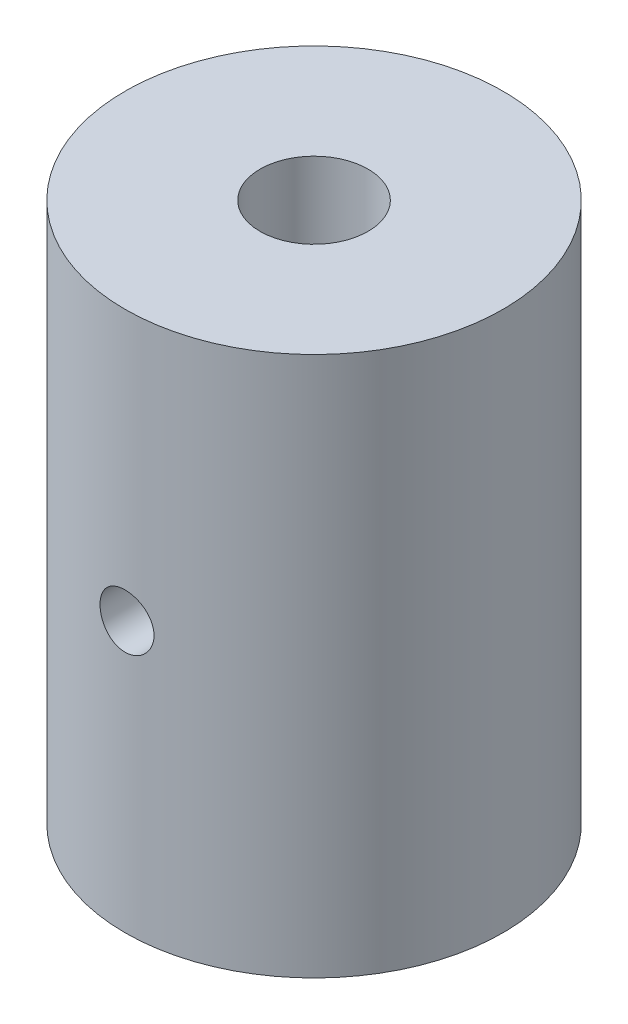
ISO-10303-21;
HEADER;
FILE_DESCRIPTION(('STEP AP214'),'2;1');
FILE_NAME('part.step','',(''),(''),'','','');
FILE_SCHEMA(('AUTOMOTIVE_DESIGN { 1 0 10303 214 1 1 1 1 }'));
ENDSEC;
DATA;
#1=APPLICATION_CONTEXT('core data for automotive mechanical design processes');
#2=APPLICATION_PROTOCOL_DEFINITION('international standard','automotive_design',2000,#1);
#3=PRODUCT_CONTEXT('',#1,'mechanical');
#4=PRODUCT('Part','Part','',(#3));
#5=PRODUCT_RELATED_PRODUCT_CATEGORY('part','',(#4));
#6=PRODUCT_DEFINITION_FORMATION('','',#4);
#7=PRODUCT_DEFINITION_CONTEXT('part definition',#1,'design');
#8=PRODUCT_DEFINITION('design','',#6,#7);
#9=PRODUCT_DEFINITION_SHAPE('','',#8);
#10=(LENGTH_UNIT() NAMED_UNIT(*) SI_UNIT(.MILLI.,.METRE.));
#11=(NAMED_UNIT(*) PLANE_ANGLE_UNIT() SI_UNIT($,.RADIAN.));
#12=(NAMED_UNIT(*) SI_UNIT($,.STERADIAN.) SOLID_ANGLE_UNIT());
#13=UNCERTAINTY_MEASURE_WITH_UNIT(LENGTH_MEASURE(1.E-05),#10,'distance_accuracy_value','');
#14=(GEOMETRIC_REPRESENTATION_CONTEXT(3) GLOBAL_UNCERTAINTY_ASSIGNED_CONTEXT((#13)) GLOBAL_UNIT_ASSIGNED_CONTEXT((#10,
#11,#12)) REPRESENTATION_CONTEXT('',''));
#15=CARTESIAN_POINT('',(0.,0.,0.));
#16=DIRECTION('',(0.,0.,1.));
#17=DIRECTION('',(1.,0.,0.));
#18=AXIS2_PLACEMENT_3D('',#15,#16,#17);
#19=CARTESIAN_POINT('',(0.,10.,0.));
#20=DIRECTION('',(0.,1.,0.));
#21=DIRECTION('',(0.,0.,1.));
#22=AXIS2_PLACEMENT_3D('',#19,#20,#21);
#23=PLANE('',#22);
#24=CARTESIAN_POINT('',(0.,10.,0.));
#25=DIRECTION('',(0.,1.,0.));
#26=DIRECTION('',(0.,0.,1.));
#27=AXIS2_PLACEMENT_3D('',#24,#25,#26);
#28=CIRCLE('',#27,3.5);
#29=CARTESIAN_POINT('',(0.,10.,3.5));
#30=VERTEX_POINT('',#29);
#31=EDGE_CURVE('E10',#30,#30,#28,.T.);
#32=ORIENTED_EDGE('',*,*,#31,.T.);
#33=EDGE_LOOP('',(#32));
#34=FACE_BOUND('',#33,.T.);
#35=CARTESIAN_POINT('',(0.,10.,0.));
#36=DIRECTION('',(0.,1.,0.));
#37=DIRECTION('',(0.,0.,1.));
#38=AXIS2_PLACEMENT_3D('',#35,#36,#37);
#39=CIRCLE('',#38,1.);
#40=CARTESIAN_POINT('',(0.,10.,1.));
#41=VERTEX_POINT('',#40);
#42=EDGE_CURVE('E49',#41,#41,#39,.T.);
#43=ORIENTED_EDGE('',*,*,#42,.F.);
#44=EDGE_LOOP('',(#43));
#45=FACE_BOUND('',#44,.T.);
#46=ADVANCED_FACE('F31',(#34,#45),#23,.T.);
#47=CARTESIAN_POINT('',(0.,0.,0.));
#48=DIRECTION('',(0.,1.,0.));
#49=DIRECTION('',(0.,0.,1.));
#50=AXIS2_PLACEMENT_3D('',#47,#48,#49);
#51=PLANE('',#50);
#52=CARTESIAN_POINT('',(0.,0.,0.));
#53=DIRECTION('',(0.,1.,0.));
#54=DIRECTION('',(0.,0.,1.));
#55=AXIS2_PLACEMENT_3D('',#52,#53,#54);
#56=CIRCLE('',#55,3.5);
#57=CARTESIAN_POINT('',(0.,0.,3.5));
#58=VERTEX_POINT('',#57);
#59=EDGE_CURVE('E44',#58,#58,#56,.T.);
#60=ORIENTED_EDGE('',*,*,#59,.F.);
#61=EDGE_LOOP('',(#60));
#62=FACE_BOUND('',#61,.T.);
#63=CARTESIAN_POINT('',(0.,0.,0.));
#64=DIRECTION('',(0.,1.,0.));
#65=DIRECTION('',(0.,0.,1.));
#66=AXIS2_PLACEMENT_3D('',#63,#64,#65);
#67=CIRCLE('',#66,1.);
#68=CARTESIAN_POINT('',(0.,0.,1.));
#69=VERTEX_POINT('',#68);
#70=EDGE_CURVE('E51',#69,#69,#67,.T.);
#71=ORIENTED_EDGE('',*,*,#70,.T.);
#72=EDGE_LOOP('',(#71));
#73=FACE_BOUND('',#72,.T.);
#74=ADVANCED_FACE('F71',(#62,#73),#51,.F.);
#75=CARTESIAN_POINT('',(0.,10.,0.));
#76=DIRECTION('',(0.,-1.,0.));
#77=DIRECTION('',(0.,0.,-1.));
#78=AXIS2_PLACEMENT_3D('',#75,#76,#77);
#79=CYLINDRICAL_SURFACE('',#78,3.5);
#80=CARTESIAN_POINT('',(0.5,5.,3.46410161513775));
#81=CARTESIAN_POINT('',(0.499998835290119,4.97206895719218,3.4641020643435));
#82=CARTESIAN_POINT('',(0.497651661268469,4.94412132181371,3.46444308020949));
#83=CARTESIAN_POINT('',(0.488326850345959,4.8890063409005,3.46576949811215));
#84=CARTESIAN_POINT('',(0.481344599054395,4.86183980112247,3.46675554228407));
#85=CARTESIAN_POINT('',(0.462961847090697,4.80909282499056,3.46925810653171));
#86=CARTESIAN_POINT('',(0.451564617805072,4.78351123047427,3.4707742337485));
#87=CARTESIAN_POINT('',(0.424682939723154,4.73462756763358,3.47416566651574));
#88=CARTESIAN_POINT('',(0.409199094751845,4.71132516324009,3.47604091899178));
#89=CARTESIAN_POINT('',(0.374463367100457,4.66748792603801,3.47995456313334));
#90=CARTESIAN_POINT('',(0.355187641068314,4.64697207153348,3.48199393618034));
#91=CARTESIAN_POINT('',(0.313466769741796,4.6094546106899,3.48599725779759));
#92=CARTESIAN_POINT('',(0.291021455462784,4.59245319183994,3.48796120233931));
#93=CARTESIAN_POINT('',(0.24347759600512,4.56237772556007,3.49160259255683));
#94=CARTESIAN_POINT('',(0.218367941554022,4.54932107137039,3.49327875573358));
#95=CARTESIAN_POINT('',(0.166284186490775,4.52761731616805,3.49614487863238));
#96=CARTESIAN_POINT('',(0.139310175509832,4.51897000333815,3.49733486170914));
#97=CARTESIAN_POINT('',(0.0844585158852377,4.50638769825893,3.49908762502242));
#98=CARTESIAN_POINT('',(0.0565882812674696,4.50242098250844,3.49965462579527));
#99=CARTESIAN_POINT('',(0.00057239131959989,4.49921402535835,3.50011198870958));
#100=CARTESIAN_POINT('',(-0.0275732499851446,4.49997354450847,3.50000238513058));
#101=CARTESIAN_POINT('',(-0.0831247480464674,4.50617234455395,3.49912227365816));
#102=CARTESIAN_POINT('',(-0.110534499942759,4.51157749972063,3.49835658533107));
#103=CARTESIAN_POINT('',(-0.164053898782174,4.5268606399248,3.49625571353159));
#104=CARTESIAN_POINT('',(-0.190163514815471,4.53673873124695,3.49492051652673));
#105=CARTESIAN_POINT('',(-0.240445491691934,4.56072268619589,3.49182235092745));
#106=CARTESIAN_POINT('',(-0.264610848197767,4.57484303777971,3.49005792042928));
#107=CARTESIAN_POINT('',(-0.310241955034411,4.60690012318507,3.48629816674057));
#108=CARTESIAN_POINT('',(-0.331707543852957,4.6248370851608,3.48430282974987));
#109=CARTESIAN_POINT('',(-0.371530747765965,4.664208650419,3.48028301235951));
#110=CARTESIAN_POINT('',(-0.389858923330459,4.6856730331873,3.47825843077807));
#111=CARTESIAN_POINT('',(-0.422657473975308,4.73138863035737,3.47442573468916));
#112=CARTESIAN_POINT('',(-0.437127829290446,4.7556398590364,3.47261762129076));
#113=CARTESIAN_POINT('',(-0.461803253801987,4.80627007247655,3.46942263420731));
#114=CARTESIAN_POINT('',(-0.472005500629445,4.83265045147065,3.46803603942467));
#115=CARTESIAN_POINT('',(-0.487826559270801,4.88677439495647,3.46584616452237));
#116=CARTESIAN_POINT('',(-0.493445662700756,4.91451787259789,3.46504284729032));
#117=CARTESIAN_POINT('',(-0.499900976720484,4.97031913435751,3.4641174518933));
#118=CARTESIAN_POINT('',(-0.50077882776118,4.9983720064989,3.46398944300777));
#119=CARTESIAN_POINT('',(-0.497837020617802,5.05422445125629,3.46441343133179));
#120=CARTESIAN_POINT('',(-0.494017494208425,5.08202403095582,3.46496540946578));
#121=CARTESIAN_POINT('',(-0.481824594638004,5.13645304500711,3.46668174131291));
#122=CARTESIAN_POINT('',(-0.473471789611052,5.16308718176633,3.46784332836313));
#123=CARTESIAN_POINT('',(-0.452470765428658,5.21457719936412,3.47064572803043));
#124=CARTESIAN_POINT('',(-0.439822352425353,5.23943299989043,3.47228656227403));
#125=CARTESIAN_POINT('',(-0.410488400828064,5.28684796993037,3.47587662103354));
#126=CARTESIAN_POINT('',(-0.393775800067812,5.30939024030309,3.47782788113076));
#127=CARTESIAN_POINT('',(-0.356825694553412,5.35136493090638,3.48181272716481));
#128=CARTESIAN_POINT('',(-0.336588009550541,5.37079719201478,3.48384631730737));
#129=CARTESIAN_POINT('',(-0.292979271571339,5.40614880460845,3.48778513103478));
#130=CARTESIAN_POINT('',(-0.269585793031082,5.42204063057988,3.48968927390463));
#131=CARTESIAN_POINT('',(-0.220437176192799,5.44966889078393,3.49313805389951));
#132=CARTESIAN_POINT('',(-0.194682097544114,5.46140542993449,3.49468270010122));
#133=CARTESIAN_POINT('',(-0.141628981148483,5.48034552857893,3.4972336946111));
#134=CARTESIAN_POINT('',(-0.114336499780982,5.48756439715687,3.49824185914305));
#135=CARTESIAN_POINT('',(-0.0589113147614463,5.49731386677665,3.49961389779132));
#136=CARTESIAN_POINT('',(-0.0307786613285695,5.49984474746346,3.49997781033809));
#137=CARTESIAN_POINT('',(0.0252607826567893,5.50014005973612,3.50002001917979));
#138=CARTESIAN_POINT('',(0.0531673554376459,5.49794670475461,3.49970438755599));
#139=CARTESIAN_POINT('',(0.108210658369968,5.48894596248924,3.49843516068761));
#140=CARTESIAN_POINT('',(0.13534739033886,5.48213858609903,3.49748156694926));
#141=CARTESIAN_POINT('',(0.188070928624313,5.46411750564295,3.49504305513564));
#142=CARTESIAN_POINT('',(0.213658657551746,5.45290645487882,3.49355845704917));
#143=CARTESIAN_POINT('',(0.262596426462871,5.42640071269949,3.49022140025573));
#144=CARTESIAN_POINT('',(0.285946407491638,5.41110591373547,3.48836893186093));
#145=CARTESIAN_POINT('',(0.329960487400663,5.37671307119416,3.48448261865867));
#146=CARTESIAN_POINT('',(0.350600041579964,5.35758377329188,3.48244736464768));
#147=CARTESIAN_POINT('',(0.388391791818108,5.31613060994117,3.47843555856542));
#148=CARTESIAN_POINT('',(0.405543166576824,5.29380599425086,3.47645902041229));
#149=CARTESIAN_POINT('',(0.435948808688983,5.24646364041609,3.47277771962972));
#150=CARTESIAN_POINT('',(0.449182885752493,5.22143282739724,3.47107438506959));
#151=CARTESIAN_POINT('',(0.471239756267733,5.16949192584885,3.46814907033844));
#152=CARTESIAN_POINT('',(0.480067194805338,5.14258385042062,3.46692658359008));
#153=CARTESIAN_POINT('',(0.491023137913952,5.09629089354243,3.46538823054796));
#154=CARTESIAN_POINT('',(0.494384406323876,5.07719391614755,3.46490825998513));
#155=CARTESIAN_POINT('',(0.498873228771313,5.03873395075835,3.46426479827912));
#156=CARTESIAN_POINT('',(0.500000807759143,5.01937096573777,3.4641013036009));
#157=CARTESIAN_POINT('',(0.5,5.,3.46410161513775));
#158=B_SPLINE_CURVE_WITH_KNOTS('',3,(#80,#81,#82,#83,#84,#85,#86,#87,#88,#89,#90,#91,#92,#93,
#94,#95,#96,#97,#98,#99,#100,#101,#102,#103,#104,#105,#106,#107,#108,#109,#110,#111,#112,#113,
#114,#115,#116,#117,#118,#119,#120,#121,#122,#123,#124,#125,#126,#127,#128,#129,#130,#131,#132,
#133,#134,#135,#136,#137,#138,#139,#140,#141,#142,#143,#144,#145,#146,#147,#148,#149,#150,#151,
#152,#153,#154,#155,#156,#157),.UNSPECIFIED.,.T.,.F.,(4,2,2,2,2,2,2,2,2,2,2,2,2,2,2,2,2,2,2,2,2,
2,2,2,2,2,2,2,2,2,2,2,2,2,2,2,2,2,4),(0.,0.0837223373489733,0.16752814862522,0.251271980342048,
0.335003445264419,0.419279289116199,0.503559627779993,0.588206326683658,0.6728489589212,
0.756914555340194,0.840975892688898,0.924424962262254,1.00787601483293,1.09161536909712,
1.17535973064625,1.25985129495926,1.34434329214935,1.42889107332132,1.51343347447084,
1.59723215270005,1.68102848019341,1.7644477520044,1.84787078877646,1.93186530252231,
2.01586411243515,2.10049480379907,2.18512335814779,2.26946355534092,2.35379872136241,
2.43738343825381,2.5209679578034,2.60450219307146,2.68803862849862,2.77228587326531,
2.85655293133939,2.94124703877999,3.02585167971589,3.0839161299067,3.14197993151379),.UNSPECIFIED.);
#159=CARTESIAN_POINT('',(0.5,5.,3.46410161513775));
#160=VERTEX_POINT('',#159);
#161=EDGE_CURVE('E54',#160,#160,#158,.T.);
#162=ORIENTED_EDGE('',*,*,#161,.T.);
#163=EDGE_LOOP('',(#162));
#164=FACE_BOUND('',#163,.T.);
#165=ORIENTED_EDGE('',*,*,#31,.F.);
#166=EDGE_LOOP('',(#165));
#167=FACE_BOUND('',#166,.T.);
#168=ORIENTED_EDGE('',*,*,#59,.T.);
#169=EDGE_LOOP('',(#168));
#170=FACE_BOUND('',#169,.T.);
#171=ADVANCED_FACE('F33',(#164,#167,#170),#79,.T.);
#172=CARTESIAN_POINT('',(0.,10.,0.));
#173=DIRECTION('',(0.,-1.,0.));
#174=DIRECTION('',(0.,0.,-1.));
#175=AXIS2_PLACEMENT_3D('',#172,#173,#174);
#176=CYLINDRICAL_SURFACE('',#175,1.);
#177=CARTESIAN_POINT('',(0.5,5.,0.866025403784439));
#178=CARTESIAN_POINT('',(0.499998181537063,4.97394609590252,0.866027673641386));
#179=CARTESIAN_POINT('',(0.497949985366554,4.94785929423752,0.867219005938538));
#180=CARTESIAN_POINT('',(0.489861604949081,4.89648636766139,0.871811832260506));
#181=CARTESIAN_POINT('',(0.483813032277104,4.87120204247829,0.875217970277862));
#182=CARTESIAN_POINT('',(0.468049974349892,4.82227416782804,0.883746733026927));
#183=CARTESIAN_POINT('',(0.458354976246861,4.79862267376321,0.888860217366243));
#184=CARTESIAN_POINT('',(0.43563376268819,4.75328789900164,0.900213324084306));
#185=CARTESIAN_POINT('',(0.422607367017888,4.73160472486877,0.906453007380328));
#186=CARTESIAN_POINT('',(0.392333270265438,4.68884713572125,0.919984345287202));
#187=CARTESIAN_POINT('',(0.374826018071885,4.66797043216323,0.927320318189766));
#188=CARTESIAN_POINT('',(0.336626903807234,4.62929580579665,0.94185991392853));
#189=CARTESIAN_POINT('',(0.315933462891146,4.61149941870824,0.94906346915625));
#190=CARTESIAN_POINT('',(0.270244781707273,4.57831642442617,0.963107384764745));
#191=CARTESIAN_POINT('',(0.245053594506288,4.56317311607024,0.969890532090862));
#192=CARTESIAN_POINT('',(0.192078513299752,4.53742957337712,0.981753780497645));
#193=CARTESIAN_POINT('',(0.164296269069078,4.52682647193142,0.986834955918708));
#194=CARTESIAN_POINT('',(0.109022471962989,4.51124766934945,0.994402306221187));
#195=CARTESIAN_POINT('',(0.0816508952444092,4.50592523682223,0.99704740110446));
#196=CARTESIAN_POINT('',(0.0262853143489244,4.49991694066248,1.00003791923034));
#197=CARTESIAN_POINT('',(-0.00170830292186906,4.49922827160214,1.00038473392295));
#198=CARTESIAN_POINT('',(-0.0549162622118749,4.50237333698517,0.998814909582251));
#199=CARTESIAN_POINT('',(-0.0801605995883955,4.50581900776061,0.997092479460802));
#200=CARTESIAN_POINT('',(-0.129656885959161,4.51644042195233,0.991871226298737));
#201=CARTESIAN_POINT('',(-0.153908760546962,4.52361644448811,0.988372270331969));
#202=CARTESIAN_POINT('',(-0.201154695784777,4.54154128304491,0.979857916438272));
#203=CARTESIAN_POINT('',(-0.224126711757589,4.55233815658603,0.974822207645996));
#204=CARTESIAN_POINT('',(-0.267988400756664,4.57713170810075,0.963688229933436));
#205=CARTESIAN_POINT('',(-0.288877324419323,4.59112953165118,0.957589580787421));
#206=CARTESIAN_POINT('',(-0.330086830449097,4.62344767576651,0.944221971996146));
#207=CARTESIAN_POINT('',(-0.35016703751468,4.642051514163,0.936896879990876));
#208=CARTESIAN_POINT('',(-0.38705218514889,4.68229486246509,0.922271702934058));
#209=CARTESIAN_POINT('',(-0.403854605787115,4.70393668613703,0.914971641328144));
#210=CARTESIAN_POINT('',(-0.434752667321106,4.75132409621204,0.900720780462423));
#211=CARTESIAN_POINT('',(-0.448608657489026,4.7772430115271,0.893821599953538));
#212=CARTESIAN_POINT('',(-0.471659556500616,4.8314688356795,0.881877251392879));
#213=CARTESIAN_POINT('',(-0.480859329105445,4.85977321650878,0.876830150230337));
#214=CARTESIAN_POINT('',(-0.49359010551252,4.9156072556414,0.869723179085172));
#215=CARTESIAN_POINT('',(-0.497512561059988,4.94302055952178,0.867458279242482));
#216=CARTESIAN_POINT('',(-0.500758473305713,4.99820067075827,0.865589596808048));
#217=CARTESIAN_POINT('',(-0.500085178657513,5.02596721455989,0.865983934446558));
#218=CARTESIAN_POINT('',(-0.494518021671983,5.07782695928936,0.869171682702924));
#219=CARTESIAN_POINT('',(-0.490093908356234,5.10198972555396,0.871697937533271));
#220=CARTESIAN_POINT('',(-0.477848142316221,5.14918389313548,0.878470107756705));
#221=CARTESIAN_POINT('',(-0.470025389311807,5.1722149253733,0.882716580025169));
#222=CARTESIAN_POINT('',(-0.450823794302443,5.21770566545135,0.892681110398283));
#223=CARTESIAN_POINT('',(-0.439297031846362,5.24008950842678,0.898458216215316));
#224=CARTESIAN_POINT('',(-0.413143532007903,5.2827346357695,0.910780597486248));
#225=CARTESIAN_POINT('',(-0.398515202166109,5.30299482175664,0.917326266775737));
#226=CARTESIAN_POINT('',(-0.364418583599427,5.34348938376177,0.93143999228168));
#227=CARTESIAN_POINT('',(-0.344572636157484,5.36339857535883,0.939032915771447));
#228=CARTESIAN_POINT('',(-0.301702247699146,5.39970611899679,0.95367117488946));
#229=CARTESIAN_POINT('',(-0.278676737327676,5.41610328511527,0.960716325038539));
#230=CARTESIAN_POINT('',(-0.229267681279378,5.44528686297505,0.973706808454791));
#231=CARTESIAN_POINT('',(-0.202811548787051,5.45796655910545,0.979618208360172));
#232=CARTESIAN_POINT('',(-0.147761182320547,5.4785689519287,0.989416774796478));
#233=CARTESIAN_POINT('',(-0.11916885069611,5.48649582568317,0.993305718381767));
#234=CARTESIAN_POINT('',(-0.0634898411651887,5.49668428208732,0.998337540909503));
#235=CARTESIAN_POINT('',(-0.0365057219251572,5.49939893793801,0.999699639541274));
#236=CARTESIAN_POINT('',(0.0175629929755304,5.50042163272725,1.00021065187534));
#237=CARTESIAN_POINT('',(0.0446475501472779,5.49873121426197,0.999360340333266));
#238=CARTESIAN_POINT('',(0.0962689961588215,5.49129179660202,0.995669844190719));
#239=CARTESIAN_POINT('',(0.120856158906529,5.48581757537054,0.992964473343949));
#240=CARTESIAN_POINT('',(0.168722976090912,5.47133650034914,0.985960468313117));
#241=CARTESIAN_POINT('',(0.192002442474414,5.4623291399556,0.981661605649085));
#242=CARTESIAN_POINT('',(0.237711703125926,5.44063647391459,0.97162965375613));
#243=CARTESIAN_POINT('',(0.260062571363279,5.42781033838687,0.965843086053095));
#244=CARTESIAN_POINT('',(0.30238732089375,5.39902103457969,0.953440665650003));
#245=CARTESIAN_POINT('',(0.322360103657879,5.38305642547661,0.946824432570784));
#246=CARTESIAN_POINT('',(0.361457002133393,5.34660143045036,0.932643051375993));
#247=CARTESIAN_POINT('',(0.380298842483295,5.32581875611261,0.925048996007109));
#248=CARTESIAN_POINT('',(0.414331643912887,5.28127463928444,0.910315381771854));
#249=CARTESIAN_POINT('',(0.429519375063787,5.25751058952455,0.903176229068854));
#250=CARTESIAN_POINT('',(0.456215539833051,5.20668167675085,0.889998026256437));
#251=CARTESIAN_POINT('',(0.467592532964975,5.17953623444635,0.884000871211844));
#252=CARTESIAN_POINT('',(0.485439354768649,5.12333379781943,0.87433078171103));
#253=CARTESIAN_POINT('',(0.491925595589966,5.09428355554207,0.870650080748793));
#254=CARTESIAN_POINT('',(0.497183503931373,5.05409732217458,0.867646363005208));
#255=CARTESIAN_POINT('',(0.498238052481696,5.04331605280122,0.867040645024728));
#256=CARTESIAN_POINT('',(0.499646702545211,5.02169175965872,0.866229679439781));
#257=CARTESIAN_POINT('',(0.50000075720002,5.010848731807,0.866024458625925));
#258=CARTESIAN_POINT('',(0.5,5.,0.866025403784439));
#259=B_SPLINE_CURVE_WITH_KNOTS('',3,(#177,#178,#179,#180,#181,#182,#183,#184,#185,#186,#187,
#188,#189,#190,#191,#192,#193,#194,#195,#196,#197,#198,#199,#200,#201,#202,#203,#204,#205,#206,
#207,#208,#209,#210,#211,#212,#213,#214,#215,#216,#217,#218,#219,#220,#221,#222,#223,#224,#225,
#226,#227,#228,#229,#230,#231,#232,#233,#234,#235,#236,#237,#238,#239,#240,#241,#242,#243,#244,
#245,#246,#247,#248,#249,#250,#251,#252,#253,#254,#255,#256,#257,#258),.UNSPECIFIED.,.T.,.F.,(4,
2,2,2,2,2,2,2,2,2,2,2,2,2,2,2,2,2,2,2,2,2,2,2,2,2,2,2,2,2,2,2,2,2,2,2,2,2,2,2,4),(0.,
0.0781160612973566,0.156396446412402,0.234264297959443,0.312136362722575,0.396431156249117,
0.480767855421855,0.570789461193817,0.660754134819455,0.744317424839676,0.8278301184302,
0.904080487422692,0.980336562587276,1.05764767365573,1.13498649675136,1.21963595728445,
1.30435024122959,1.39444420864724,1.48444387105853,1.56731145427106,1.65012046594186,
1.72387091712013,1.79764526218031,1.87483648203044,1.95206743110024,2.03903371790306,
2.12602932489101,2.21532090706483,2.30453389904386,2.38556135194743,2.46656043396986,
2.54222212435746,2.61789466756007,2.69680375359736,2.7757491505036,2.8625512092522,
2.94942971422226,3.03905374518951,3.12837566501029,3.16090067592303,3.19342786246919),.UNSPECIFIED.);
#260=CARTESIAN_POINT('',(0.5,5.,0.866025403784439));
#261=VERTEX_POINT('',#260);
#262=EDGE_CURVE('E36',#261,#261,#259,.T.);
#263=ORIENTED_EDGE('',*,*,#262,.F.);
#264=EDGE_LOOP('',(#263));
#265=FACE_BOUND('',#264,.T.);
#266=ORIENTED_EDGE('',*,*,#42,.T.);
#267=EDGE_LOOP('',(#266));
#268=FACE_BOUND('',#267,.T.);
#269=ORIENTED_EDGE('',*,*,#70,.F.);
#270=EDGE_LOOP('',(#269));
#271=FACE_BOUND('',#270,.T.);
#272=ADVANCED_FACE('F63',(#265,#268,#271),#176,.F.);
#273=CARTESIAN_POINT('',(0.,5.,0.));
#274=DIRECTION('',(0.,0.,1.));
#275=DIRECTION('',(1.,0.,0.));
#276=AXIS2_PLACEMENT_3D('',#273,#274,#275);
#277=CYLINDRICAL_SURFACE('',#276,0.5);
#278=ORIENTED_EDGE('',*,*,#262,.T.);
#279=EDGE_LOOP('',(#278));
#280=FACE_BOUND('',#279,.T.);
#281=ORIENTED_EDGE('',*,*,#161,.F.);
#282=EDGE_LOOP('',(#281));
#283=FACE_BOUND('',#282,.T.);
#284=ADVANCED_FACE('F60',(#280,#283),#277,.F.);
#285=CLOSED_SHELL('',(#46,#74,#171,#272,#284));
#286=MANIFOLD_SOLID_BREP('B2',#285);
#287=ADVANCED_BREP_SHAPE_REPRESENTATION('',(#18,#286),#14);
#288=SHAPE_DEFINITION_REPRESENTATION(#9,#287);
ENDSEC;
END-ISO-10303-21;
